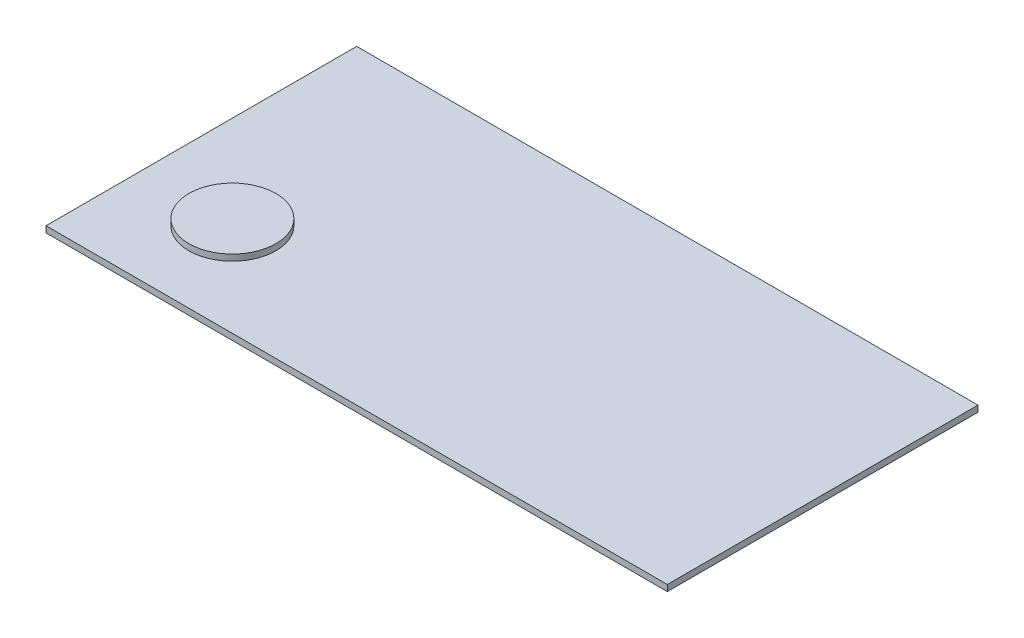
ISO-10303-21;
HEADER;
FILE_DESCRIPTION(('STEP AP214'),'2;1');
FILE_NAME('part.step','',(''),(''),'','','');
FILE_SCHEMA(('AUTOMOTIVE_DESIGN { 1 0 10303 214 1 1 1 1 }'));
ENDSEC;
DATA;
#1=APPLICATION_CONTEXT('core data for automotive mechanical design processes');
#2=APPLICATION_PROTOCOL_DEFINITION('international standard','automotive_design',2000,#1);
#3=PRODUCT_CONTEXT('',#1,'mechanical');
#4=PRODUCT('Part','Part','',(#3));
#5=PRODUCT_RELATED_PRODUCT_CATEGORY('part','',(#4));
#6=PRODUCT_DEFINITION_FORMATION('','',#4);
#7=PRODUCT_DEFINITION_CONTEXT('part definition',#1,'design');
#8=PRODUCT_DEFINITION('design','',#6,#7);
#9=PRODUCT_DEFINITION_SHAPE('','',#8);
#10=(LENGTH_UNIT() NAMED_UNIT(*) SI_UNIT(.MILLI.,.METRE.));
#11=(NAMED_UNIT(*) PLANE_ANGLE_UNIT() SI_UNIT($,.RADIAN.));
#12=(NAMED_UNIT(*) SI_UNIT($,.STERADIAN.) SOLID_ANGLE_UNIT());
#13=UNCERTAINTY_MEASURE_WITH_UNIT(LENGTH_MEASURE(1.E-05),#10,'distance_accuracy_value','');
#14=(GEOMETRIC_REPRESENTATION_CONTEXT(3) GLOBAL_UNCERTAINTY_ASSIGNED_CONTEXT((#13)) GLOBAL_UNIT_ASSIGNED_CONTEXT((#10,
#11,#12)) REPRESENTATION_CONTEXT('',''));
#15=CARTESIAN_POINT('',(0.,0.,0.));
#16=DIRECTION('',(0.,0.,1.));
#17=DIRECTION('',(1.,0.,0.));
#18=AXIS2_PLACEMENT_3D('',#15,#16,#17);
#19=CARTESIAN_POINT('',(500.,10.,-250.));
#20=DIRECTION('',(-1.,0.,0.));
#21=DIRECTION('',(0.,0.,1.));
#22=AXIS2_PLACEMENT_3D('',#19,#20,#21);
#23=PLANE('',#22);
#24=DIRECTION('',(0.,0.,-1.));
#25=VECTOR('',#24,1.);
#26=CARTESIAN_POINT('',(500.,0.,-250.));
#27=LINE('',#26,#25);
#28=CARTESIAN_POINT('',(500.,0.,250.));
#29=VERTEX_POINT('',#28);
#30=CARTESIAN_POINT('',(500.,0.,-250.));
#31=VERTEX_POINT('',#30);
#32=EDGE_CURVE('E99',#29,#31,#27,.T.);
#33=ORIENTED_EDGE('',*,*,#32,.T.);
#34=DIRECTION('',(0.,-1.,0.));
#35=VECTOR('',#34,1.);
#36=CARTESIAN_POINT('',(500.,10.,-250.));
#37=LINE('',#36,#35);
#38=CARTESIAN_POINT('',(500.,10.,-250.));
#39=VERTEX_POINT('',#38);
#40=EDGE_CURVE('E11',#39,#31,#37,.T.);
#41=ORIENTED_EDGE('',*,*,#40,.F.);
#42=DIRECTION('',(0.,0.,-1.));
#43=VECTOR('',#42,1.);
#44=CARTESIAN_POINT('',(500.,10.,-250.));
#45=LINE('',#44,#43);
#46=CARTESIAN_POINT('',(500.,10.,250.));
#47=VERTEX_POINT('',#46);
#48=EDGE_CURVE('E87',#47,#39,#45,.T.);
#49=ORIENTED_EDGE('',*,*,#48,.F.);
#50=DIRECTION('',(0.,-1.,0.));
#51=VECTOR('',#50,1.);
#52=CARTESIAN_POINT('',(500.,10.,250.));
#53=LINE('',#52,#51);
#54=EDGE_CURVE('E95',#47,#29,#53,.T.);
#55=ORIENTED_EDGE('',*,*,#54,.T.);
#56=EDGE_LOOP('',(#33,#41,#49,#55));
#57=FACE_BOUND('',#56,.T.);
#58=ADVANCED_FACE('F36',(#57),#23,.F.);
#59=CARTESIAN_POINT('',(-500.,10.,-250.));
#60=DIRECTION('',(0.,0.,1.));
#61=DIRECTION('',(1.,0.,0.));
#62=AXIS2_PLACEMENT_3D('',#59,#60,#61);
#63=PLANE('',#62);
#64=DIRECTION('',(-1.,0.,0.));
#65=VECTOR('',#64,1.);
#66=CARTESIAN_POINT('',(-500.,0.,-250.));
#67=LINE('',#66,#65);
#68=CARTESIAN_POINT('',(-500.,0.,-250.));
#69=VERTEX_POINT('',#68);
#70=EDGE_CURVE('E91',#31,#69,#67,.T.);
#71=ORIENTED_EDGE('',*,*,#70,.T.);
#72=DIRECTION('',(0.,-1.,0.));
#73=VECTOR('',#72,1.);
#74=CARTESIAN_POINT('',(-500.,10.,-250.));
#75=LINE('',#74,#73);
#76=CARTESIAN_POINT('',(-500.,10.,-250.));
#77=VERTEX_POINT('',#76);
#78=EDGE_CURVE('E44',#77,#69,#75,.T.);
#79=ORIENTED_EDGE('',*,*,#78,.F.);
#80=DIRECTION('',(-1.,0.,0.));
#81=VECTOR('',#80,1.);
#82=CARTESIAN_POINT('',(-500.,10.,-250.));
#83=LINE('',#82,#81);
#84=EDGE_CURVE('E82',#39,#77,#83,.T.);
#85=ORIENTED_EDGE('',*,*,#84,.F.);
#86=ORIENTED_EDGE('',*,*,#40,.T.);
#87=EDGE_LOOP('',(#71,#79,#85,#86));
#88=FACE_BOUND('',#87,.T.);
#89=ADVANCED_FACE('F90',(#88),#63,.F.);
#90=CARTESIAN_POINT('',(-500.,10.,-250.));
#91=DIRECTION('',(1.,0.,0.));
#92=DIRECTION('',(0.,0.,-1.));
#93=AXIS2_PLACEMENT_3D('',#90,#91,#92);
#94=PLANE('',#93);
#95=DIRECTION('',(0.,0.,1.));
#96=VECTOR('',#95,1.);
#97=CARTESIAN_POINT('',(-500.,0.,-250.));
#98=LINE('',#97,#96);
#99=CARTESIAN_POINT('',(-500.,0.,250.));
#100=VERTEX_POINT('',#99);
#101=EDGE_CURVE('E69',#69,#100,#98,.T.);
#102=ORIENTED_EDGE('',*,*,#101,.T.);
#103=DIRECTION('',(0.,-1.,0.));
#104=VECTOR('',#103,1.);
#105=CARTESIAN_POINT('',(-500.,10.,250.));
#106=LINE('',#105,#104);
#107=CARTESIAN_POINT('',(-500.,10.,250.));
#108=VERTEX_POINT('',#107);
#109=EDGE_CURVE('E92',#108,#100,#106,.T.);
#110=ORIENTED_EDGE('',*,*,#109,.F.);
#111=DIRECTION('',(0.,0.,1.));
#112=VECTOR('',#111,1.);
#113=CARTESIAN_POINT('',(-500.,10.,-250.));
#114=LINE('',#113,#112);
#115=EDGE_CURVE('E85',#77,#108,#114,.T.);
#116=ORIENTED_EDGE('',*,*,#115,.F.);
#117=ORIENTED_EDGE('',*,*,#78,.T.);
#118=EDGE_LOOP('',(#102,#110,#116,#117));
#119=FACE_BOUND('',#118,.T.);
#120=ADVANCED_FACE('F93',(#119),#94,.F.);
#121=CARTESIAN_POINT('',(-500.,10.,250.));
#122=DIRECTION('',(0.,0.,-1.));
#123=DIRECTION('',(-1.,0.,0.));
#124=AXIS2_PLACEMENT_3D('',#121,#122,#123);
#125=PLANE('',#124);
#126=DIRECTION('',(1.,0.,0.));
#127=VECTOR('',#126,1.);
#128=CARTESIAN_POINT('',(-500.,0.,250.));
#129=LINE('',#128,#127);
#130=EDGE_CURVE('E75',#100,#29,#129,.T.);
#131=ORIENTED_EDGE('',*,*,#130,.T.);
#132=ORIENTED_EDGE('',*,*,#54,.F.);
#133=DIRECTION('',(1.,0.,0.));
#134=VECTOR('',#133,1.);
#135=CARTESIAN_POINT('',(-500.,10.,250.));
#136=LINE('',#135,#134);
#137=EDGE_CURVE('E52',#108,#47,#136,.T.);
#138=ORIENTED_EDGE('',*,*,#137,.F.);
#139=ORIENTED_EDGE('',*,*,#109,.T.);
#140=EDGE_LOOP('',(#131,#132,#138,#139));
#141=FACE_BOUND('',#140,.T.);
#142=ADVANCED_FACE('F107',(#141),#125,.F.);
#143=CARTESIAN_POINT('',(0.,10.,0.));
#144=DIRECTION('',(0.,1.,0.));
#145=DIRECTION('',(0.,0.,1.));
#146=AXIS2_PLACEMENT_3D('',#143,#144,#145);
#147=PLANE('',#146);
#148=CARTESIAN_POINT('',(-350.,10.,100.));
#149=DIRECTION('',(0.,1.,0.));
#150=DIRECTION('',(0.,0.,1.));
#151=AXIS2_PLACEMENT_3D('',#148,#149,#150);
#152=CIRCLE('',#151,70.);
#153=CARTESIAN_POINT('',(-350.,10.,170.));
#154=VERTEX_POINT('',#153);
#155=EDGE_CURVE('E113',#154,#154,#152,.T.);
#156=ORIENTED_EDGE('',*,*,#155,.F.);
#157=EDGE_LOOP('',(#156));
#158=FACE_BOUND('',#157,.T.);
#159=ORIENTED_EDGE('',*,*,#48,.T.);
#160=ORIENTED_EDGE('',*,*,#84,.T.);
#161=ORIENTED_EDGE('',*,*,#115,.T.);
#162=ORIENTED_EDGE('',*,*,#137,.T.);
#163=EDGE_LOOP('',(#159,#160,#161,#162));
#164=FACE_BOUND('',#163,.T.);
#165=ADVANCED_FACE('F83',(#158,#164),#147,.T.);
#166=CARTESIAN_POINT('',(0.,0.,0.));
#167=DIRECTION('',(0.,1.,0.));
#168=DIRECTION('',(0.,0.,1.));
#169=AXIS2_PLACEMENT_3D('',#166,#167,#168);
#170=PLANE('',#169);
#171=ORIENTED_EDGE('',*,*,#32,.F.);
#172=ORIENTED_EDGE('',*,*,#130,.F.);
#173=ORIENTED_EDGE('',*,*,#101,.F.);
#174=ORIENTED_EDGE('',*,*,#70,.F.);
#175=EDGE_LOOP('',(#171,#172,#173,#174));
#176=FACE_BOUND('',#175,.T.);
#177=ADVANCED_FACE('F110',(#176),#170,.F.);
#178=CARTESIAN_POINT('',(-350.,20.,100.));
#179=DIRECTION('',(0.,-1.,0.));
#180=DIRECTION('',(0.,0.,-1.));
#181=AXIS2_PLACEMENT_3D('',#178,#179,#180);
#182=CYLINDRICAL_SURFACE('',#181,70.);
#183=CARTESIAN_POINT('',(-350.,20.,100.));
#184=DIRECTION('',(0.,1.,0.));
#185=DIRECTION('',(0.,0.,1.));
#186=AXIS2_PLACEMENT_3D('',#183,#184,#185);
#187=CIRCLE('',#186,70.);
#188=CARTESIAN_POINT('',(-350.,20.,170.));
#189=VERTEX_POINT('',#188);
#190=EDGE_CURVE('E102',#189,#189,#187,.T.);
#191=ORIENTED_EDGE('',*,*,#190,.F.);
#192=EDGE_LOOP('',(#191));
#193=FACE_BOUND('',#192,.T.);
#194=ORIENTED_EDGE('',*,*,#155,.T.);
#195=EDGE_LOOP('',(#194));
#196=FACE_BOUND('',#195,.T.);
#197=ADVANCED_FACE('F121',(#193,#196),#182,.T.);
#198=CARTESIAN_POINT('',(-350.,20.,100.));
#199=DIRECTION('',(0.,1.,0.));
#200=DIRECTION('',(0.,0.,1.));
#201=AXIS2_PLACEMENT_3D('',#198,#199,#200);
#202=PLANE('',#201);
#203=ORIENTED_EDGE('',*,*,#190,.T.);
#204=EDGE_LOOP('',(#203));
#205=FACE_BOUND('',#204,.T.);
#206=ADVANCED_FACE('F119',(#205),#202,.T.);
#207=CLOSED_SHELL('',(#58,#89,#120,#142,#165,#177,#197,#206));
#208=MANIFOLD_SOLID_BREP('B2',#207);
#209=ADVANCED_BREP_SHAPE_REPRESENTATION('',(#18,#208),#14);
#210=SHAPE_DEFINITION_REPRESENTATION(#9,#209);
ENDSEC;
END-ISO-10303-21;
